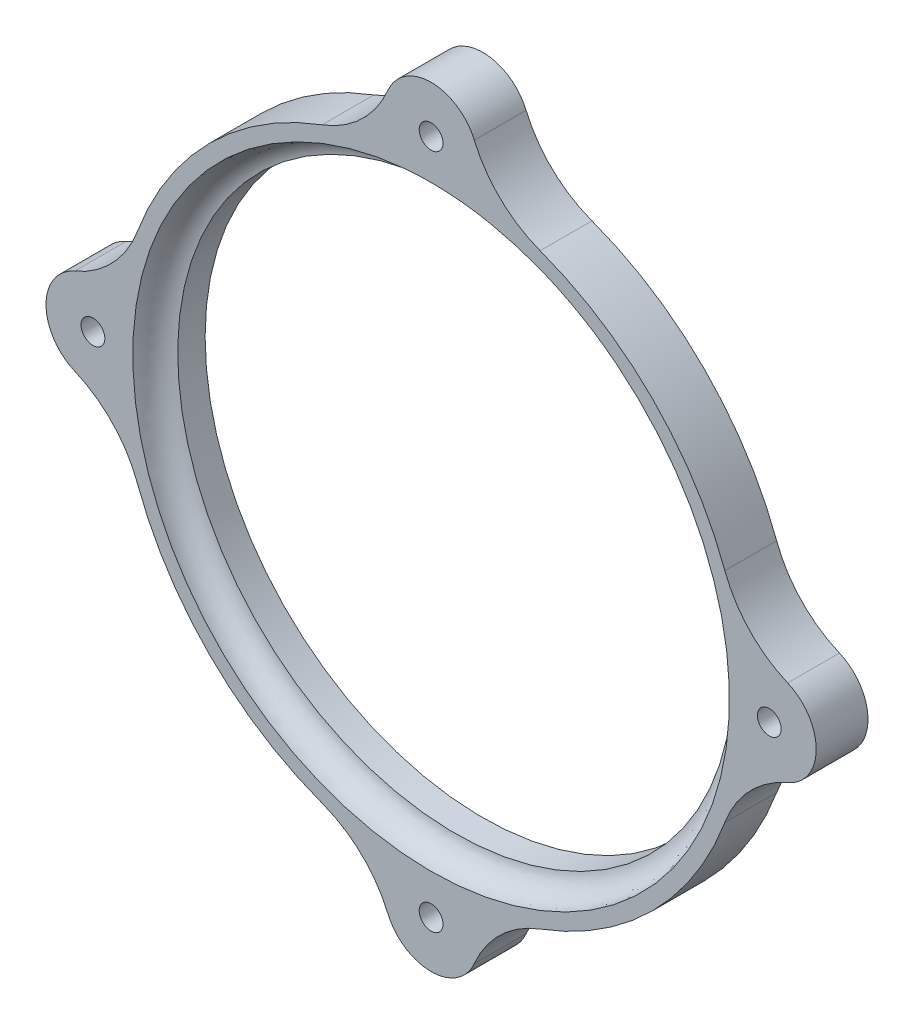
ISO-10303-21;
HEADER;
FILE_DESCRIPTION(('STEP AP214'),'2;1');
FILE_NAME('part.step','',(''),(''),'','','');
FILE_SCHEMA(('AUTOMOTIVE_DESIGN { 1 0 10303 214 1 1 1 1 }'));
ENDSEC;
DATA;
#1=APPLICATION_CONTEXT('core data for automotive mechanical design processes');
#2=APPLICATION_PROTOCOL_DEFINITION('international standard','automotive_design',2000,#1);
#3=PRODUCT_CONTEXT('',#1,'mechanical');
#4=PRODUCT('Part','Part','',(#3));
#5=PRODUCT_RELATED_PRODUCT_CATEGORY('part','',(#4));
#6=PRODUCT_DEFINITION_FORMATION('','',#4);
#7=PRODUCT_DEFINITION_CONTEXT('part definition',#1,'design');
#8=PRODUCT_DEFINITION('design','',#6,#7);
#9=PRODUCT_DEFINITION_SHAPE('','',#8);
#10=(LENGTH_UNIT() NAMED_UNIT(*) SI_UNIT(.MILLI.,.METRE.));
#11=(NAMED_UNIT(*) PLANE_ANGLE_UNIT() SI_UNIT($,.RADIAN.));
#12=(NAMED_UNIT(*) SI_UNIT($,.STERADIAN.) SOLID_ANGLE_UNIT());
#13=UNCERTAINTY_MEASURE_WITH_UNIT(LENGTH_MEASURE(1.E-05),#10,'distance_accuracy_value','');
#14=(GEOMETRIC_REPRESENTATION_CONTEXT(3) GLOBAL_UNCERTAINTY_ASSIGNED_CONTEXT((#13)) GLOBAL_UNIT_ASSIGNED_CONTEXT((#10,
#11,#12)) REPRESENTATION_CONTEXT('',''));
#15=CARTESIAN_POINT('',(0.,0.,0.));
#16=DIRECTION('',(0.,0.,1.));
#17=DIRECTION('',(1.,0.,0.));
#18=AXIS2_PLACEMENT_3D('',#15,#16,#17);
#19=CARTESIAN_POINT('',(0.,114.634431643275,75.6018381281527));
#20=DIRECTION('',(0.,6.07607714142588E-13,-1.));
#21=DIRECTION('',(1.,0.,0.));
#22=AXIS2_PLACEMENT_3D('',#19,#20,#21);
#23=PLANE('',#22);
#24=CARTESIAN_POINT('',(-32.8778362500431,57.3172158216366,75.6018381281178));
#25=DIRECTION('',(0.,6.07607714142588E-13,-1.));
#26=DIRECTION('',(1.,0.,0.));
#27=AXIS2_PLACEMENT_3D('',#24,#25,#26);
#28=CIRCLE('',#27,1.54999999999999);
#29=CARTESIAN_POINT('',(-31.3278362500431,57.3172158216366,75.6018381281178));
#30=VERTEX_POINT('',#29);
#31=EDGE_CURVE('E37',#30,#30,#28,.T.);
#32=ORIENTED_EDGE('',*,*,#31,.T.);
#33=EDGE_LOOP('',(#32));
#34=FACE_BOUND('',#33,.T.);
#35=CARTESIAN_POINT('',(11.2096637499571,101.404715821637,75.6018381281446));
#36=DIRECTION('',(0.,6.07607714142588E-13,-1.));
#37=DIRECTION('',(1.,0.,0.));
#38=AXIS2_PLACEMENT_3D('',#35,#36,#37);
#39=CIRCLE('',#38,1.54999999999999);
#40=CARTESIAN_POINT('',(12.759663749957,101.404715821637,75.6018381281446));
#41=VERTEX_POINT('',#40);
#42=EDGE_CURVE('E260',#41,#41,#39,.T.);
#43=ORIENTED_EDGE('',*,*,#42,.T.);
#44=EDGE_LOOP('',(#43));
#45=FACE_BOUND('',#44,.T.);
#46=CARTESIAN_POINT('',(55.2971637499569,57.3172158216366,75.6018381281178));
#47=DIRECTION('',(0.,6.07607714142588E-13,-1.));
#48=DIRECTION('',(1.,0.,0.));
#49=AXIS2_PLACEMENT_3D('',#46,#47,#48);
#50=CIRCLE('',#49,1.54999999999999);
#51=CARTESIAN_POINT('',(56.8471637499569,57.3172158216366,75.6018381281178));
#52=VERTEX_POINT('',#51);
#53=EDGE_CURVE('E42',#52,#52,#50,.T.);
#54=ORIENTED_EDGE('',*,*,#53,.T.);
#55=EDGE_LOOP('',(#54));
#56=FACE_BOUND('',#55,.T.);
#57=CARTESIAN_POINT('',(11.2096637499564,13.2297158216366,75.6018381280911));
#58=DIRECTION('',(0.,6.07607714142588E-13,-1.));
#59=DIRECTION('',(1.,0.,0.));
#60=AXIS2_PLACEMENT_3D('',#57,#58,#59);
#61=CIRCLE('',#60,1.54999999999999);
#62=CARTESIAN_POINT('',(12.7596637499564,13.2297158216366,75.6018381280911));
#63=VERTEX_POINT('',#62);
#64=EDGE_CURVE('E11',#63,#63,#61,.T.);
#65=ORIENTED_EDGE('',*,*,#64,.T.);
#66=EDGE_LOOP('',(#65));
#67=FACE_BOUND('',#66,.T.);
#68=CARTESIAN_POINT('',(11.2096637499569,57.3172158216366,75.6018381281178));
#69=DIRECTION('',(0.,-6.07607714142588E-13,1.));
#70=DIRECTION('',(-1.,0.,0.));
#71=AXIS2_PLACEMENT_3D('',#68,#69,#70);
#72=CIRCLE('',#71,38.8936810507353);
#73=CARTESIAN_POINT('',(0.,20.0739363703151,75.6018381280952));
#74=VERTEX_POINT('',#73);
#75=EDGE_CURVE('E222',#74,#74,#72,.T.);
#76=ORIENTED_EDGE('',*,*,#75,.F.);
#77=EDGE_LOOP('',(#76));
#78=FACE_BOUND('',#77,.T.);
#79=CARTESIAN_POINT('',(11.2096637499571,101.404715821637,75.6018381281446));
#80=DIRECTION('',(0.,6.07607714142588E-13,-1.));
#81=DIRECTION('',(1.,0.,0.));
#82=AXIS2_PLACEMENT_3D('',#79,#80,#81);
#83=CIRCLE('',#82,6.120135742462);
#84=CARTESIAN_POINT('',(5.57851822527572,103.80185194335,75.6018381281461));
#85=VERTEX_POINT('',#84);
#86=CARTESIAN_POINT('',(16.8408092746384,103.80185194335,75.6018381281461));
#87=VERTEX_POINT('',#86);
#88=EDGE_CURVE('E249',#85,#87,#83,.T.);
#89=ORIENTED_EDGE('',*,*,#88,.F.);
#90=CARTESIAN_POINT('',(-8.2230029214171,109.677055262163,75.6018381281497));
#91=DIRECTION('',(0.,6.07607714142588E-13,-1.));
#92=DIRECTION('',(1.,0.,0.));
#93=AXIS2_PLACEMENT_3D('',#90,#91,#92);
#94=CIRCLE('',#93,15.);
#95=CARTESIAN_POINT('',(-3.003810008131,95.6143376964182,75.6018381281411));
#96=VERTEX_POINT('',#95);
#97=EDGE_CURVE('E234',#96,#85,#94,.F.);
#98=ORIENTED_EDGE('',*,*,#97,.F.);
#99=CARTESIAN_POINT('',(11.2096637499569,57.3172158216366,75.6018381281178));
#100=DIRECTION('',(0.,6.07607714142588E-13,-1.));
#101=DIRECTION('',(1.,0.,0.));
#102=AXIS2_PLACEMENT_3D('',#99,#100,#101);
#103=CIRCLE('',#102,40.8496313344897);
#104=CARTESIAN_POINT('',(-27.0874581248246,71.5306895797247,75.6018381281265));
#105=VERTEX_POINT('',#104);
#106=EDGE_CURVE('E243',#105,#96,#103,.T.);
#107=ORIENTED_EDGE('',*,*,#106,.F.);
#108=CARTESIAN_POINT('',(-41.1501756905693,76.7498824930108,75.6018381281297));
#109=DIRECTION('',(0.,6.07607714142588E-13,-1.));
#110=DIRECTION('',(1.,0.,0.));
#111=AXIS2_PLACEMENT_3D('',#108,#109,#110);
#112=CIRCLE('',#111,15.);
#113=CARTESIAN_POINT('',(-35.2749723717563,62.948361346318,75.6018381281213));
#114=VERTEX_POINT('',#113);
#115=EDGE_CURVE('E241',#114,#105,#112,.F.);
#116=ORIENTED_EDGE('',*,*,#115,.F.);
#117=CARTESIAN_POINT('',(-32.8778362500431,57.3172158216366,75.6018381281178));
#118=DIRECTION('',(0.,6.07607714142588E-13,-1.));
#119=DIRECTION('',(1.,0.,0.));
#120=AXIS2_PLACEMENT_3D('',#117,#118,#119);
#121=CIRCLE('',#120,6.120135742462);
#122=CARTESIAN_POINT('',(-35.2749723717563,51.6860702969553,75.6018381281144));
#123=VERTEX_POINT('',#122);
#124=EDGE_CURVE('E240',#123,#114,#121,.T.);
#125=ORIENTED_EDGE('',*,*,#124,.F.);
#126=CARTESIAN_POINT('',(-41.1501756905693,37.8845491502625,75.601838128106));
#127=DIRECTION('',(0.,6.07607714142588E-13,-1.));
#128=DIRECTION('',(1.,0.,0.));
#129=AXIS2_PLACEMENT_3D('',#126,#127,#128);
#130=CIRCLE('',#129,15.);
#131=CARTESIAN_POINT('',(-27.0874581248246,43.1037420635486,75.6018381281092));
#132=VERTEX_POINT('',#131);
#133=EDGE_CURVE('E57',#132,#123,#130,.F.);
#134=ORIENTED_EDGE('',*,*,#133,.F.);
#135=CARTESIAN_POINT('',(11.2096637499569,57.3172158216366,75.6018381281178));
#136=DIRECTION('',(0.,6.07607714142588E-13,-1.));
#137=DIRECTION('',(1.,0.,0.));
#138=AXIS2_PLACEMENT_3D('',#135,#136,#137);
#139=CIRCLE('',#138,40.8496313344897);
#140=CARTESIAN_POINT('',(-3.00381000813154,19.0200939468553,75.6018381280946));
#141=VERTEX_POINT('',#140);
#142=EDGE_CURVE('E50',#141,#132,#139,.T.);
#143=ORIENTED_EDGE('',*,*,#142,.F.);
#144=CARTESIAN_POINT('',(-8.22300292141783,4.95737638111067,75.601838128086));
#145=DIRECTION('',(0.,6.07607714142588E-13,-1.));
#146=DIRECTION('',(1.,0.,0.));
#147=AXIS2_PLACEMENT_3D('',#144,#145,#146);
#148=CIRCLE('',#147,15.);
#149=CARTESIAN_POINT('',(5.57851822527506,10.8325796999234,75.6018381280896));
#150=VERTEX_POINT('',#149);
#151=EDGE_CURVE('E224',#150,#141,#148,.F.);
#152=ORIENTED_EDGE('',*,*,#151,.F.);
#153=CARTESIAN_POINT('',(11.2096637499564,13.2297158216366,75.6018381280911));
#154=DIRECTION('',(0.,6.07607714142588E-13,-1.));
#155=DIRECTION('',(1.,0.,0.));
#156=AXIS2_PLACEMENT_3D('',#153,#154,#155);
#157=CIRCLE('',#156,6.120135742462);
#158=CARTESIAN_POINT('',(16.8408092746377,10.8325796999233,75.6018381280896));
#159=VERTEX_POINT('',#158);
#160=EDGE_CURVE('E231',#159,#150,#157,.T.);
#161=ORIENTED_EDGE('',*,*,#160,.F.);
#162=CARTESIAN_POINT('',(30.6423304213305,4.95737638111025,75.601838128086));
#163=DIRECTION('',(0.,6.07607714142588E-13,-1.));
#164=DIRECTION('',(1.,0.,0.));
#165=AXIS2_PLACEMENT_3D('',#162,#163,#164);
#166=CIRCLE('',#165,15.);
#167=CARTESIAN_POINT('',(25.4231375080445,19.020093946855,75.6018381280946));
#168=VERTEX_POINT('',#167);
#169=EDGE_CURVE('E226',#168,#159,#166,.F.);
#170=ORIENTED_EDGE('',*,*,#169,.F.);
#171=CARTESIAN_POINT('',(11.2096637499569,57.3172158216366,75.6018381281178));
#172=DIRECTION('',(0.,6.07607714142588E-13,-1.));
#173=DIRECTION('',(1.,0.,0.));
#174=AXIS2_PLACEMENT_3D('',#171,#172,#173);
#175=CIRCLE('',#174,40.8496313344897);
#176=CARTESIAN_POINT('',(49.5067856247384,43.1037420635486,75.6018381281092));
#177=VERTEX_POINT('',#176);
#178=EDGE_CURVE('E236',#177,#168,#175,.T.);
#179=ORIENTED_EDGE('',*,*,#178,.F.);
#180=CARTESIAN_POINT('',(63.569503190483,37.8845491502625,75.601838128106));
#181=DIRECTION('',(0.,6.07607714142588E-13,-1.));
#182=DIRECTION('',(1.,0.,0.));
#183=AXIS2_PLACEMENT_3D('',#180,#181,#182);
#184=CIRCLE('',#183,15.);
#185=CARTESIAN_POINT('',(57.6942998716701,51.6860702969553,75.6018381281144));
#186=VERTEX_POINT('',#185);
#187=EDGE_CURVE('E238',#186,#177,#184,.F.);
#188=ORIENTED_EDGE('',*,*,#187,.F.);
#189=CARTESIAN_POINT('',(55.2971637499569,57.3172158216366,75.6018381281178));
#190=DIRECTION('',(0.,6.07607714142588E-13,-1.));
#191=DIRECTION('',(1.,0.,0.));
#192=AXIS2_PLACEMENT_3D('',#189,#190,#191);
#193=CIRCLE('',#192,6.120135742462);
#194=CARTESIAN_POINT('',(57.6942998716701,62.948361346318,75.6018381281213));
#195=VERTEX_POINT('',#194);
#196=EDGE_CURVE('E233',#195,#186,#193,.T.);
#197=ORIENTED_EDGE('',*,*,#196,.F.);
#198=CARTESIAN_POINT('',(63.569503190483,76.7498824930108,75.6018381281297));
#199=DIRECTION('',(0.,6.07607714142588E-13,-1.));
#200=DIRECTION('',(1.,0.,0.));
#201=AXIS2_PLACEMENT_3D('',#198,#199,#200);
#202=CIRCLE('',#201,15.);
#203=CARTESIAN_POINT('',(49.5067856247384,71.5306895797247,75.6018381281265));
#204=VERTEX_POINT('',#203);
#205=EDGE_CURVE('E247',#204,#195,#202,.F.);
#206=ORIENTED_EDGE('',*,*,#205,.F.);
#207=CARTESIAN_POINT('',(11.2096637499569,57.3172158216366,75.6018381281178));
#208=DIRECTION('',(0.,6.07607714142588E-13,-1.));
#209=DIRECTION('',(1.,0.,0.));
#210=AXIS2_PLACEMENT_3D('',#207,#208,#209);
#211=CIRCLE('',#210,40.8496313344897);
#212=CARTESIAN_POINT('',(25.423137508045,95.6143376964181,75.6018381281411));
#213=VERTEX_POINT('',#212);
#214=EDGE_CURVE('E245',#213,#204,#211,.T.);
#215=ORIENTED_EDGE('',*,*,#214,.F.);
#216=CARTESIAN_POINT('',(30.6423304213312,109.677055262163,75.6018381281497));
#217=DIRECTION('',(0.,6.07607714142588E-13,-1.));
#218=DIRECTION('',(1.,0.,0.));
#219=AXIS2_PLACEMENT_3D('',#216,#217,#218);
#220=CIRCLE('',#219,15.);
#221=EDGE_CURVE('E253',#87,#213,#220,.F.);
#222=ORIENTED_EDGE('',*,*,#221,.F.);
#223=EDGE_LOOP('',(#89,#98,#107,#116,#125,#134,#143,#152,#161,#170,#179,#188,#197,#206,#215,#222));
#224=FACE_BOUND('',#223,.T.);
#225=ADVANCED_FACE('F34',(#34,#45,#56,#67,#78,#224),#23,.F.);
#226=CARTESIAN_POINT('',(11.2096637499569,57.3172158216407,68.8518381281178));
#227=DIRECTION('',(0.,-6.07607714142588E-13,1.));
#228=DIRECTION('',(-1.,0.,0.));
#229=AXIS2_PLACEMENT_3D('',#226,#227,#228);
#230=PLANE('',#229);
#231=CARTESIAN_POINT('',(11.2096637499569,57.3172158216407,68.8518381281178));
#232=DIRECTION('',(0.,-6.07607714142588E-13,1.));
#233=DIRECTION('',(-1.,0.,0.));
#234=AXIS2_PLACEMENT_3D('',#231,#232,#233);
#235=CIRCLE('',#234,40.8496313344897);
#236=CARTESIAN_POINT('',(-27.0874581248246,43.1037420635527,68.8518381281092));
#237=VERTEX_POINT('',#236);
#238=CARTESIAN_POINT('',(-3.00381000813154,19.0200939468594,68.8518381280946));
#239=VERTEX_POINT('',#238);
#240=EDGE_CURVE('E158',#237,#239,#235,.T.);
#241=ORIENTED_EDGE('',*,*,#240,.F.);
#242=CARTESIAN_POINT('',(-41.1501756905693,37.8845491502666,68.8518381281061));
#243=DIRECTION('',(0.,-6.07607714142588E-13,1.));
#244=DIRECTION('',(-1.,0.,0.));
#245=AXIS2_PLACEMENT_3D('',#242,#243,#244);
#246=CIRCLE('',#245,15.);
#247=CARTESIAN_POINT('',(-35.2749723717563,51.6860702969594,68.8518381281144));
#248=VERTEX_POINT('',#247);
#249=EDGE_CURVE('E163',#237,#248,#246,.T.);
#250=ORIENTED_EDGE('',*,*,#249,.T.);
#251=CARTESIAN_POINT('',(-32.8778362500431,57.3172158216407,68.8518381281178));
#252=DIRECTION('',(0.,-6.07607714142588E-13,1.));
#253=DIRECTION('',(-1.,0.,0.));
#254=AXIS2_PLACEMENT_3D('',#251,#252,#253);
#255=CIRCLE('',#254,6.120135742462);
#256=CARTESIAN_POINT('',(-35.2749723717563,62.9483613463221,68.8518381281213));
#257=VERTEX_POINT('',#256);
#258=EDGE_CURVE('E189',#257,#248,#255,.T.);
#259=ORIENTED_EDGE('',*,*,#258,.F.);
#260=CARTESIAN_POINT('',(-41.1501756905693,76.7498824930149,68.8518381281297));
#261=DIRECTION('',(0.,-6.07607714142588E-13,1.));
#262=DIRECTION('',(-1.,0.,0.));
#263=AXIS2_PLACEMENT_3D('',#260,#261,#262);
#264=CIRCLE('',#263,15.);
#265=CARTESIAN_POINT('',(-27.0874581248246,71.5306895797287,68.8518381281265));
#266=VERTEX_POINT('',#265);
#267=EDGE_CURVE('E170',#257,#266,#264,.T.);
#268=ORIENTED_EDGE('',*,*,#267,.T.);
#269=CARTESIAN_POINT('',(-3.003810008131,95.6143376964223,68.8518381281411));
#270=VERTEX_POINT('',#269);
#271=EDGE_CURVE('E179',#270,#266,#235,.T.);
#272=ORIENTED_EDGE('',*,*,#271,.F.);
#273=CARTESIAN_POINT('',(-8.2230029214171,109.677055262167,68.8518381281497));
#274=DIRECTION('',(0.,-6.07607714142588E-13,1.));
#275=DIRECTION('',(-1.,0.,0.));
#276=AXIS2_PLACEMENT_3D('',#273,#274,#275);
#277=CIRCLE('',#276,15.);
#278=CARTESIAN_POINT('',(5.57851822527572,103.801851943354,68.8518381281461));
#279=VERTEX_POINT('',#278);
#280=EDGE_CURVE('E405',#270,#279,#277,.T.);
#281=ORIENTED_EDGE('',*,*,#280,.T.);
#282=CARTESIAN_POINT('',(11.2096637499571,101.404715821641,68.8518381281446));
#283=DIRECTION('',(0.,-6.07607714142588E-13,1.));
#284=DIRECTION('',(0.,1.,6.07607714142588E-13));
#285=AXIS2_PLACEMENT_3D('',#282,#283,#284);
#286=CIRCLE('',#285,6.120135742462);
#287=CARTESIAN_POINT('',(16.8408092746384,103.801851943354,68.8518381281461));
#288=VERTEX_POINT('',#287);
#289=EDGE_CURVE('E196',#288,#279,#286,.T.);
#290=ORIENTED_EDGE('',*,*,#289,.F.);
#291=CARTESIAN_POINT('',(30.6423304213312,109.677055262167,68.8518381281497));
#292=DIRECTION('',(0.,-6.07607714142588E-13,1.));
#293=DIRECTION('',(-1.,0.,0.));
#294=AXIS2_PLACEMENT_3D('',#291,#292,#293);
#295=CIRCLE('',#294,15.);
#296=CARTESIAN_POINT('',(25.423137508045,95.6143376964222,68.8518381281411));
#297=VERTEX_POINT('',#296);
#298=EDGE_CURVE('E407',#288,#297,#295,.T.);
#299=ORIENTED_EDGE('',*,*,#298,.T.);
#300=CARTESIAN_POINT('',(49.5067856247384,71.5306895797288,68.8518381281265));
#301=VERTEX_POINT('',#300);
#302=EDGE_CURVE('E182',#301,#297,#235,.T.);
#303=ORIENTED_EDGE('',*,*,#302,.F.);
#304=CARTESIAN_POINT('',(63.569503190483,76.7498824930149,68.8518381281297));
#305=DIRECTION('',(0.,-6.07607714142588E-13,1.));
#306=DIRECTION('',(-1.,0.,0.));
#307=AXIS2_PLACEMENT_3D('',#304,#305,#306);
#308=CIRCLE('',#307,15.);
#309=CARTESIAN_POINT('',(57.6942998716701,62.9483613463221,68.8518381281213));
#310=VERTEX_POINT('',#309);
#311=EDGE_CURVE('E420',#301,#310,#308,.T.);
#312=ORIENTED_EDGE('',*,*,#311,.T.);
#313=CARTESIAN_POINT('',(55.2971637499569,57.3172158216407,68.8518381281178));
#314=DIRECTION('',(0.,-6.07607714142588E-13,1.));
#315=DIRECTION('',(1.,0.,0.));
#316=AXIS2_PLACEMENT_3D('',#313,#314,#315);
#317=CIRCLE('',#316,6.120135742462);
#318=CARTESIAN_POINT('',(57.6942998716701,51.6860702969594,68.8518381281144));
#319=VERTEX_POINT('',#318);
#320=EDGE_CURVE('E202',#319,#310,#317,.T.);
#321=ORIENTED_EDGE('',*,*,#320,.F.);
#322=CARTESIAN_POINT('',(63.569503190483,37.8845491502666,68.8518381281061));
#323=DIRECTION('',(0.,-6.07607714142588E-13,1.));
#324=DIRECTION('',(-1.,0.,0.));
#325=AXIS2_PLACEMENT_3D('',#322,#323,#324);
#326=CIRCLE('',#325,15.);
#327=CARTESIAN_POINT('',(49.5067856247384,43.1037420635527,68.8518381281092));
#328=VERTEX_POINT('',#327);
#329=EDGE_CURVE('E371',#319,#328,#326,.T.);
#330=ORIENTED_EDGE('',*,*,#329,.T.);
#331=CARTESIAN_POINT('',(25.4231375080445,19.0200939468591,68.8518381280946));
#332=VERTEX_POINT('',#331);
#333=EDGE_CURVE('E177',#332,#328,#235,.T.);
#334=ORIENTED_EDGE('',*,*,#333,.F.);
#335=CARTESIAN_POINT('',(30.6423304213305,4.95737638111435,68.851838128086));
#336=DIRECTION('',(0.,-6.07607714142588E-13,1.));
#337=DIRECTION('',(-1.,0.,0.));
#338=AXIS2_PLACEMENT_3D('',#335,#336,#337);
#339=CIRCLE('',#338,15.);
#340=CARTESIAN_POINT('',(16.8408092746377,10.8325796999274,68.8518381280896));
#341=VERTEX_POINT('',#340);
#342=EDGE_CURVE('E376',#332,#341,#339,.T.);
#343=ORIENTED_EDGE('',*,*,#342,.T.);
#344=CARTESIAN_POINT('',(11.2096637499564,13.2297158216407,68.8518381280911));
#345=DIRECTION('',(0.,-6.07607714142588E-13,1.));
#346=DIRECTION('',(0.,-1.,-6.07607714142588E-13));
#347=AXIS2_PLACEMENT_3D('',#344,#345,#346);
#348=CIRCLE('',#347,6.120135742462);
#349=CARTESIAN_POINT('',(5.57851822527506,10.8325796999275,68.8518381280896));
#350=VERTEX_POINT('',#349);
#351=EDGE_CURVE('E208',#350,#341,#348,.T.);
#352=ORIENTED_EDGE('',*,*,#351,.F.);
#353=CARTESIAN_POINT('',(-8.22300292141783,4.95737638111476,68.851838128086));
#354=DIRECTION('',(0.,-6.07607714142588E-13,1.));
#355=DIRECTION('',(-1.,0.,0.));
#356=AXIS2_PLACEMENT_3D('',#353,#354,#355);
#357=CIRCLE('',#356,15.);
#358=EDGE_CURVE('E176',#350,#239,#357,.T.);
#359=ORIENTED_EDGE('',*,*,#358,.T.);
#360=EDGE_LOOP('',(#241,#250,#259,#268,#272,#281,#290,#299,#303,#312,#321,#330,#334,#343,#352,#359));
#361=FACE_BOUND('',#360,.T.);
#362=CARTESIAN_POINT('',(11.2096637499569,57.3172158216407,68.8518381281178));
#363=DIRECTION('',(0.,-6.07607714142588E-13,1.));
#364=DIRECTION('',(-1.,0.,0.));
#365=AXIS2_PLACEMENT_3D('',#362,#363,#364);
#366=CIRCLE('',#365,36.2163369894019);
#367=CARTESIAN_POINT('',(-25.006673239445,57.3172158216407,68.8518381281178));
#368=VERTEX_POINT('',#367);
#369=EDGE_CURVE('E184',#368,#368,#366,.T.);
#370=ORIENTED_EDGE('',*,*,#369,.T.);
#371=EDGE_LOOP('',(#370));
#372=FACE_BOUND('',#371,.T.);
#373=CARTESIAN_POINT('',(-32.8778362500431,57.3172158216407,68.8518381281178));
#374=DIRECTION('',(0.,-6.07607714142588E-13,1.));
#375=DIRECTION('',(-1.,0.,0.));
#376=AXIS2_PLACEMENT_3D('',#373,#374,#375);
#377=CIRCLE('',#376,1.54999999999999);
#378=CARTESIAN_POINT('',(-34.4278362500431,57.3172158216407,68.8518381281178));
#379=VERTEX_POINT('',#378);
#380=EDGE_CURVE('E191',#379,#379,#377,.T.);
#381=ORIENTED_EDGE('',*,*,#380,.T.);
#382=EDGE_LOOP('',(#381));
#383=FACE_BOUND('',#382,.T.);
#384=CARTESIAN_POINT('',(11.2096637499571,101.404715821641,68.8518381281446));
#385=DIRECTION('',(0.,-6.07607714142588E-13,1.));
#386=DIRECTION('',(0.,1.,6.07607714142588E-13));
#387=AXIS2_PLACEMENT_3D('',#384,#385,#386);
#388=CIRCLE('',#387,1.54999999999999);
#389=CARTESIAN_POINT('',(11.2096637499571,102.954715821641,68.8518381281456));
#390=VERTEX_POINT('',#389);
#391=EDGE_CURVE('E199',#390,#390,#388,.T.);
#392=ORIENTED_EDGE('',*,*,#391,.T.);
#393=EDGE_LOOP('',(#392));
#394=FACE_BOUND('',#393,.T.);
#395=CARTESIAN_POINT('',(55.2971637499569,57.3172158216407,68.8518381281178));
#396=DIRECTION('',(0.,-6.07607714142588E-13,1.));
#397=DIRECTION('',(1.,0.,0.));
#398=AXIS2_PLACEMENT_3D('',#395,#396,#397);
#399=CIRCLE('',#398,1.54999999999999);
#400=CARTESIAN_POINT('',(56.8471637499569,57.3172158216407,68.8518381281178));
#401=VERTEX_POINT('',#400);
#402=EDGE_CURVE('E205',#401,#401,#399,.T.);
#403=ORIENTED_EDGE('',*,*,#402,.T.);
#404=EDGE_LOOP('',(#403));
#405=FACE_BOUND('',#404,.T.);
#406=CARTESIAN_POINT('',(11.2096637499564,13.2297158216407,68.8518381280911));
#407=DIRECTION('',(0.,-6.07607714142588E-13,1.));
#408=DIRECTION('',(0.,-1.,-6.07607714142588E-13));
#409=AXIS2_PLACEMENT_3D('',#406,#407,#408);
#410=CIRCLE('',#409,1.54999999999999);
#411=CARTESIAN_POINT('',(11.2096637499564,11.6797158216407,68.8518381280901));
#412=VERTEX_POINT('',#411);
#413=EDGE_CURVE('E211',#412,#412,#410,.T.);
#414=ORIENTED_EDGE('',*,*,#413,.T.);
#415=EDGE_LOOP('',(#414));
#416=FACE_BOUND('',#415,.T.);
#417=ADVANCED_FACE('F172',(#361,#372,#383,#394,#405,#416),#230,.F.);
#418=CARTESIAN_POINT('',(11.2096637499569,57.3172158216325,82.3518381281179));
#419=DIRECTION('',(0.,6.07607714142588E-13,-1.));
#420=DIRECTION('',(1.,0.,0.));
#421=AXIS2_PLACEMENT_3D('',#418,#419,#420);
#422=CYLINDRICAL_SURFACE('',#421,40.8496313344897);
#423=DIRECTION('',(0.,6.07607714142588E-13,-1.));
#424=VECTOR('',#423,1.);
#425=CARTESIAN_POINT('',(-3.00381000813154,19.0200939468512,82.3518381280946));
#426=LINE('',#425,#424);
#427=EDGE_CURVE('E369',#239,#141,#426,.F.);
#428=ORIENTED_EDGE('',*,*,#427,.T.);
#429=ORIENTED_EDGE('',*,*,#142,.T.);
#430=DIRECTION('',(0.,6.07607714142588E-13,-1.));
#431=VECTOR('',#430,1.);
#432=CARTESIAN_POINT('',(-27.0874581248246,43.1037420635445,82.3518381281092));
#433=LINE('',#432,#431);
#434=EDGE_CURVE('E154',#132,#237,#433,.T.);
#435=ORIENTED_EDGE('',*,*,#434,.T.);
#436=ORIENTED_EDGE('',*,*,#240,.T.);
#437=EDGE_LOOP('',(#428,#429,#435,#436));
#438=FACE_BOUND('',#437,.T.);
#439=ADVANCED_FACE('F156',(#438),#422,.T.);
#440=CARTESIAN_POINT('',(11.2096637499564,13.229715821623,98.0438221719009));
#441=DIRECTION('',(0.,6.07607714142588E-13,-1.));
#442=DIRECTION('',(1.,0.,0.));
#443=AXIS2_PLACEMENT_3D('',#440,#441,#442);
#444=CYLINDRICAL_SURFACE('',#443,6.120135742462);
#445=DIRECTION('',(0.,6.07607714142588E-13,-1.));
#446=VECTOR('',#445,1.);
#447=CARTESIAN_POINT('',(16.8408092746377,10.8325796999097,98.0438221718994));
#448=LINE('',#447,#446);
#449=EDGE_CURVE('E365',#341,#159,#448,.F.);
#450=ORIENTED_EDGE('',*,*,#449,.T.);
#451=ORIENTED_EDGE('',*,*,#160,.T.);
#452=DIRECTION('',(0.,6.07607714142588E-13,-1.));
#453=VECTOR('',#452,1.);
#454=CARTESIAN_POINT('',(5.57851822527506,10.8325796999098,98.0438221718994));
#455=LINE('',#454,#453);
#456=EDGE_CURVE('E363',#150,#350,#455,.T.);
#457=ORIENTED_EDGE('',*,*,#456,.T.);
#458=ORIENTED_EDGE('',*,*,#351,.T.);
#459=EDGE_LOOP('',(#450,#451,#457,#458));
#460=FACE_BOUND('',#459,.T.);
#461=ADVANCED_FACE('F327',(#460),#444,.T.);
#462=CARTESIAN_POINT('',(-8.22300292141783,4.95737638110656,82.351838128086));
#463=DIRECTION('',(0.,-6.07607714142588E-13,1.));
#464=DIRECTION('',(-1.,0.,0.));
#465=AXIS2_PLACEMENT_3D('',#462,#463,#464);
#466=CYLINDRICAL_SURFACE('',#465,15.);
#467=ORIENTED_EDGE('',*,*,#456,.F.);
#468=ORIENTED_EDGE('',*,*,#151,.T.);
#469=ORIENTED_EDGE('',*,*,#427,.F.);
#470=ORIENTED_EDGE('',*,*,#358,.F.);
#471=EDGE_LOOP('',(#467,#468,#469,#470));
#472=FACE_BOUND('',#471,.T.);
#473=ADVANCED_FACE('F353',(#472),#466,.F.);
#474=DIRECTION('',(0.,6.07607714142588E-13,-1.));
#475=VECTOR('',#474,1.);
#476=CARTESIAN_POINT('',(49.5067856247384,43.1037420635445,82.3518381281092));
#477=LINE('',#476,#475);
#478=EDGE_CURVE('E417',#328,#177,#477,.F.);
#479=ORIENTED_EDGE('',*,*,#478,.T.);
#480=ORIENTED_EDGE('',*,*,#178,.T.);
#481=DIRECTION('',(0.,6.07607714142588E-13,-1.));
#482=VECTOR('',#481,1.);
#483=CARTESIAN_POINT('',(25.4231375080445,19.0200939468509,82.3518381280946));
#484=LINE('',#483,#482);
#485=EDGE_CURVE('E366',#168,#332,#484,.T.);
#486=ORIENTED_EDGE('',*,*,#485,.T.);
#487=ORIENTED_EDGE('',*,*,#333,.T.);
#488=EDGE_LOOP('',(#479,#480,#486,#487));
#489=FACE_BOUND('',#488,.T.);
#490=ADVANCED_FACE('F328',(#489),#422,.T.);
#491=CARTESIAN_POINT('',(30.6423304213305,4.95737638109661,98.0438221718958));
#492=DIRECTION('',(0.,-6.07607714142588E-13,1.));
#493=DIRECTION('',(-1.,0.,0.));
#494=AXIS2_PLACEMENT_3D('',#491,#492,#493);
#495=CYLINDRICAL_SURFACE('',#494,15.);
#496=ORIENTED_EDGE('',*,*,#485,.F.);
#497=ORIENTED_EDGE('',*,*,#169,.T.);
#498=ORIENTED_EDGE('',*,*,#449,.F.);
#499=ORIENTED_EDGE('',*,*,#342,.F.);
#500=EDGE_LOOP('',(#496,#497,#498,#499));
#501=FACE_BOUND('',#500,.T.);
#502=ADVANCED_FACE('F350',(#501),#495,.F.);
#503=CARTESIAN_POINT('',(55.2971637499569,57.317215821623,98.0438221719276));
#504=DIRECTION('',(0.,6.07607714142588E-13,-1.));
#505=DIRECTION('',(1.,0.,0.));
#506=AXIS2_PLACEMENT_3D('',#503,#504,#505);
#507=CYLINDRICAL_SURFACE('',#506,6.120135742462);
#508=DIRECTION('',(0.,6.07607714142588E-13,-1.));
#509=VECTOR('',#508,1.);
#510=CARTESIAN_POINT('',(57.6942998716701,62.9483613463043,98.0438221719311));
#511=LINE('',#510,#509);
#512=EDGE_CURVE('E414',#310,#195,#511,.F.);
#513=ORIENTED_EDGE('',*,*,#512,.T.);
#514=ORIENTED_EDGE('',*,*,#196,.T.);
#515=DIRECTION('',(0.,6.07607714142588E-13,-1.));
#516=VECTOR('',#515,1.);
#517=CARTESIAN_POINT('',(57.6942998716701,51.6860702969417,98.0438221719242));
#518=LINE('',#517,#516);
#519=EDGE_CURVE('E412',#186,#319,#518,.T.);
#520=ORIENTED_EDGE('',*,*,#519,.T.);
#521=ORIENTED_EDGE('',*,*,#320,.T.);
#522=EDGE_LOOP('',(#513,#514,#520,#521));
#523=FACE_BOUND('',#522,.T.);
#524=ADVANCED_FACE('F348',(#523),#507,.T.);
#525=CARTESIAN_POINT('',(63.569503190483,37.8845491502584,82.351838128106));
#526=DIRECTION('',(0.,-6.07607714142588E-13,1.));
#527=DIRECTION('',(-1.,0.,0.));
#528=AXIS2_PLACEMENT_3D('',#525,#526,#527);
#529=CYLINDRICAL_SURFACE('',#528,15.);
#530=ORIENTED_EDGE('',*,*,#519,.F.);
#531=ORIENTED_EDGE('',*,*,#187,.T.);
#532=ORIENTED_EDGE('',*,*,#478,.F.);
#533=ORIENTED_EDGE('',*,*,#329,.F.);
#534=EDGE_LOOP('',(#530,#531,#532,#533));
#535=FACE_BOUND('',#534,.T.);
#536=ADVANCED_FACE('F345',(#535),#529,.F.);
#537=DIRECTION('',(0.,6.07607714142588E-13,-1.));
#538=VECTOR('',#537,1.);
#539=CARTESIAN_POINT('',(25.423137508045,95.614337696414,82.3518381281411));
#540=LINE('',#539,#538);
#541=EDGE_CURVE('E402',#297,#213,#540,.F.);
#542=ORIENTED_EDGE('',*,*,#541,.T.);
#543=ORIENTED_EDGE('',*,*,#214,.T.);
#544=DIRECTION('',(0.,6.07607714142588E-13,-1.));
#545=VECTOR('',#544,1.);
#546=CARTESIAN_POINT('',(49.5067856247384,71.5306895797206,82.3518381281265));
#547=LINE('',#546,#545);
#548=EDGE_CURVE('E410',#204,#301,#547,.T.);
#549=ORIENTED_EDGE('',*,*,#548,.T.);
#550=ORIENTED_EDGE('',*,*,#302,.T.);
#551=EDGE_LOOP('',(#542,#543,#549,#550));
#552=FACE_BOUND('',#551,.T.);
#553=ADVANCED_FACE('F343',(#552),#422,.T.);
#554=CARTESIAN_POINT('',(63.569503190483,76.7498824929972,98.0438221719395));
#555=DIRECTION('',(0.,-6.07607714142588E-13,1.));
#556=DIRECTION('',(-1.,0.,0.));
#557=AXIS2_PLACEMENT_3D('',#554,#555,#556);
#558=CYLINDRICAL_SURFACE('',#557,15.);
#559=ORIENTED_EDGE('',*,*,#548,.F.);
#560=ORIENTED_EDGE('',*,*,#205,.T.);
#561=ORIENTED_EDGE('',*,*,#512,.F.);
#562=ORIENTED_EDGE('',*,*,#311,.F.);
#563=EDGE_LOOP('',(#559,#560,#561,#562));
#564=FACE_BOUND('',#563,.T.);
#565=ADVANCED_FACE('F340',(#564),#558,.F.);
#566=CARTESIAN_POINT('',(11.2096637499571,101.404715821623,98.0438221719544));
#567=DIRECTION('',(0.,6.07607714142588E-13,-1.));
#568=DIRECTION('',(1.,0.,0.));
#569=AXIS2_PLACEMENT_3D('',#566,#567,#568);
#570=CYLINDRICAL_SURFACE('',#569,6.120135742462);
#571=DIRECTION('',(0.,6.07607714142588E-13,-1.));
#572=VECTOR('',#571,1.);
#573=CARTESIAN_POINT('',(5.57851822527572,103.801851943336,98.0438221719559));
#574=LINE('',#573,#572);
#575=EDGE_CURVE('E399',#279,#85,#574,.F.);
#576=ORIENTED_EDGE('',*,*,#575,.T.);
#577=ORIENTED_EDGE('',*,*,#88,.T.);
#578=DIRECTION('',(0.,6.07607714142588E-13,-1.));
#579=VECTOR('',#578,1.);
#580=CARTESIAN_POINT('',(16.8408092746384,103.801851943336,98.0438221719559));
#581=LINE('',#580,#579);
#582=EDGE_CURVE('E397',#87,#288,#581,.T.);
#583=ORIENTED_EDGE('',*,*,#582,.T.);
#584=ORIENTED_EDGE('',*,*,#289,.T.);
#585=EDGE_LOOP('',(#576,#577,#583,#584));
#586=FACE_BOUND('',#585,.T.);
#587=ADVANCED_FACE('F338',(#586),#570,.T.);
#588=CARTESIAN_POINT('',(30.6423304213312,109.677055262159,82.3518381281497));
#589=DIRECTION('',(0.,-6.07607714142588E-13,1.));
#590=DIRECTION('',(-1.,0.,0.));
#591=AXIS2_PLACEMENT_3D('',#588,#589,#590);
#592=CYLINDRICAL_SURFACE('',#591,15.);
#593=ORIENTED_EDGE('',*,*,#582,.F.);
#594=ORIENTED_EDGE('',*,*,#221,.T.);
#595=ORIENTED_EDGE('',*,*,#541,.F.);
#596=ORIENTED_EDGE('',*,*,#298,.F.);
#597=EDGE_LOOP('',(#593,#594,#595,#596));
#598=FACE_BOUND('',#597,.T.);
#599=ADVANCED_FACE('F335',(#598),#592,.F.);
#600=DIRECTION('',(0.,6.07607714142588E-13,-1.));
#601=VECTOR('',#600,1.);
#602=CARTESIAN_POINT('',(-27.0874581248246,71.5306895797206,82.3518381281265));
#603=LINE('',#602,#601);
#604=EDGE_CURVE('E161',#266,#105,#603,.F.);
#605=ORIENTED_EDGE('',*,*,#604,.T.);
#606=ORIENTED_EDGE('',*,*,#106,.T.);
#607=DIRECTION('',(0.,6.07607714142588E-13,-1.));
#608=VECTOR('',#607,1.);
#609=CARTESIAN_POINT('',(-3.003810008131,95.6143376964141,82.3518381281411));
#610=LINE('',#609,#608);
#611=EDGE_CURVE('E395',#96,#270,#610,.T.);
#612=ORIENTED_EDGE('',*,*,#611,.T.);
#613=ORIENTED_EDGE('',*,*,#271,.T.);
#614=EDGE_LOOP('',(#605,#606,#612,#613));
#615=FACE_BOUND('',#614,.T.);
#616=ADVANCED_FACE('F297',(#615),#422,.T.);
#617=CARTESIAN_POINT('',(-8.2230029214171,109.677055262149,98.0438221719594));
#618=DIRECTION('',(0.,-6.07607714142588E-13,1.));
#619=DIRECTION('',(-1.,0.,0.));
#620=AXIS2_PLACEMENT_3D('',#617,#618,#619);
#621=CYLINDRICAL_SURFACE('',#620,15.);
#622=ORIENTED_EDGE('',*,*,#611,.F.);
#623=ORIENTED_EDGE('',*,*,#97,.T.);
#624=ORIENTED_EDGE('',*,*,#575,.F.);
#625=ORIENTED_EDGE('',*,*,#280,.F.);
#626=EDGE_LOOP('',(#622,#623,#624,#625));
#627=FACE_BOUND('',#626,.T.);
#628=ADVANCED_FACE('F287',(#627),#621,.F.);
#629=CARTESIAN_POINT('',(11.2096637499564,13.229715821623,98.0438221719009));
#630=DIRECTION('',(0.,6.07607714142588E-13,-1.));
#631=DIRECTION('',(1.,0.,0.));
#632=AXIS2_PLACEMENT_3D('',#629,#630,#631);
#633=CYLINDRICAL_SURFACE('',#632,1.54999999999999);
#634=ORIENTED_EDGE('',*,*,#64,.F.);
#635=EDGE_LOOP('',(#634));
#636=FACE_BOUND('',#635,.T.);
#637=ORIENTED_EDGE('',*,*,#413,.F.);
#638=EDGE_LOOP('',(#637));
#639=FACE_BOUND('',#638,.T.);
#640=ADVANCED_FACE('F284',(#636,#639),#633,.F.);
#641=CARTESIAN_POINT('',(55.2971637499569,57.317215821623,98.0438221719276));
#642=DIRECTION('',(0.,6.07607714142588E-13,-1.));
#643=DIRECTION('',(1.,0.,0.));
#644=AXIS2_PLACEMENT_3D('',#641,#642,#643);
#645=CYLINDRICAL_SURFACE('',#644,1.54999999999999);
#646=ORIENTED_EDGE('',*,*,#53,.F.);
#647=EDGE_LOOP('',(#646));
#648=FACE_BOUND('',#647,.T.);
#649=ORIENTED_EDGE('',*,*,#402,.F.);
#650=EDGE_LOOP('',(#649));
#651=FACE_BOUND('',#650,.T.);
#652=ADVANCED_FACE('F286',(#648,#651),#645,.F.);
#653=CARTESIAN_POINT('',(11.2096637499571,101.404715821623,98.0438221719544));
#654=DIRECTION('',(0.,6.07607714142588E-13,-1.));
#655=DIRECTION('',(1.,0.,0.));
#656=AXIS2_PLACEMENT_3D('',#653,#654,#655);
#657=CYLINDRICAL_SURFACE('',#656,1.54999999999999);
#658=ORIENTED_EDGE('',*,*,#42,.F.);
#659=EDGE_LOOP('',(#658));
#660=FACE_BOUND('',#659,.T.);
#661=ORIENTED_EDGE('',*,*,#391,.F.);
#662=EDGE_LOOP('',(#661));
#663=FACE_BOUND('',#662,.T.);
#664=ADVANCED_FACE('F294',(#660,#663),#657,.F.);
#665=CARTESIAN_POINT('',(-32.8778362500431,57.317215821623,98.0438221719276));
#666=DIRECTION('',(0.,6.07607714142588E-13,-1.));
#667=DIRECTION('',(1.,0.,0.));
#668=AXIS2_PLACEMENT_3D('',#665,#666,#667);
#669=CYLINDRICAL_SURFACE('',#668,6.120135742462);
#670=DIRECTION('',(0.,6.07607714142588E-13,-1.));
#671=VECTOR('',#670,1.);
#672=CARTESIAN_POINT('',(-35.2749723717563,51.6860702969417,98.0438221719242));
#673=LINE('',#672,#671);
#674=EDGE_CURVE('E166',#248,#123,#673,.F.);
#675=ORIENTED_EDGE('',*,*,#674,.T.);
#676=ORIENTED_EDGE('',*,*,#124,.T.);
#677=DIRECTION('',(0.,6.07607714142588E-13,-1.));
#678=VECTOR('',#677,1.);
#679=CARTESIAN_POINT('',(-35.2749723717563,62.9483613463043,98.0438221719311));
#680=LINE('',#679,#678);
#681=EDGE_CURVE('E160',#114,#257,#680,.T.);
#682=ORIENTED_EDGE('',*,*,#681,.T.);
#683=ORIENTED_EDGE('',*,*,#258,.T.);
#684=EDGE_LOOP('',(#675,#676,#682,#683));
#685=FACE_BOUND('',#684,.T.);
#686=ADVANCED_FACE('F323',(#685),#669,.T.);
#687=CARTESIAN_POINT('',(-41.1501756905693,76.7498824930067,82.3518381281297));
#688=DIRECTION('',(0.,-6.07607714142588E-13,1.));
#689=DIRECTION('',(-1.,0.,0.));
#690=AXIS2_PLACEMENT_3D('',#687,#688,#689);
#691=CYLINDRICAL_SURFACE('',#690,15.);
#692=ORIENTED_EDGE('',*,*,#681,.F.);
#693=ORIENTED_EDGE('',*,*,#115,.T.);
#694=ORIENTED_EDGE('',*,*,#604,.F.);
#695=ORIENTED_EDGE('',*,*,#267,.F.);
#696=EDGE_LOOP('',(#692,#693,#694,#695));
#697=FACE_BOUND('',#696,.T.);
#698=ADVANCED_FACE('F331',(#697),#691,.F.);
#699=CARTESIAN_POINT('',(-41.1501756905693,37.8845491502488,98.0438221719158));
#700=DIRECTION('',(0.,-6.07607714142588E-13,1.));
#701=DIRECTION('',(-1.,0.,0.));
#702=AXIS2_PLACEMENT_3D('',#699,#700,#701);
#703=CYLINDRICAL_SURFACE('',#702,15.);
#704=ORIENTED_EDGE('',*,*,#434,.F.);
#705=ORIENTED_EDGE('',*,*,#133,.T.);
#706=ORIENTED_EDGE('',*,*,#674,.F.);
#707=ORIENTED_EDGE('',*,*,#249,.F.);
#708=EDGE_LOOP('',(#704,#705,#706,#707));
#709=FACE_BOUND('',#708,.T.);
#710=ADVANCED_FACE('F164',(#709),#703,.F.);
#711=CARTESIAN_POINT('',(-32.8778362500431,57.317215821623,98.0438221719276));
#712=DIRECTION('',(0.,6.07607714142588E-13,-1.));
#713=DIRECTION('',(1.,0.,0.));
#714=AXIS2_PLACEMENT_3D('',#711,#712,#713);
#715=CYLINDRICAL_SURFACE('',#714,1.54999999999999);
#716=ORIENTED_EDGE('',*,*,#31,.F.);
#717=EDGE_LOOP('',(#716));
#718=FACE_BOUND('',#717,.T.);
#719=ORIENTED_EDGE('',*,*,#380,.F.);
#720=EDGE_LOOP('',(#719));
#721=FACE_BOUND('',#720,.T.);
#722=ADVANCED_FACE('F268',(#718,#721),#715,.F.);
#723=CARTESIAN_POINT('',(11.2096637499569,57.3172158216325,82.3518381281179));
#724=DIRECTION('',(0.,6.07607714142588E-13,-1.));
#725=DIRECTION('',(1.,0.,0.));
#726=AXIS2_PLACEMENT_3D('',#723,#724,#725);
#727=CYLINDRICAL_SURFACE('',#726,36.2163369894019);
#728=CARTESIAN_POINT('',(11.2096637499569,57.3172158216386,72.4262590110947));
#729=DIRECTION('',(0.,-6.07607714142588E-13,1.));
#730=DIRECTION('',(-1.,0.,0.));
#731=AXIS2_PLACEMENT_3D('',#728,#729,#730);
#732=CIRCLE('',#731,36.2163369894019);
#733=CARTESIAN_POINT('',(0.,22.8793514345599,72.4262590110738));
#734=VERTEX_POINT('',#733);
#735=EDGE_CURVE('E220',#734,#734,#732,.F.);
#736=ORIENTED_EDGE('',*,*,#735,.F.);
#737=EDGE_LOOP('',(#736));
#738=FACE_BOUND('',#737,.T.);
#739=ORIENTED_EDGE('',*,*,#369,.F.);
#740=EDGE_LOOP('',(#739));
#741=FACE_BOUND('',#740,.T.);
#742=ADVANCED_FACE('F271',(#738,#741),#727,.F.);
#743=CARTESIAN_POINT('',(0.,23.2739363703131,78.8018381280972));
#744=CARTESIAN_POINT('',(68.0865589026431,0.854608870399357,78.8018381280836));
#745=CARTESIAN_POINT('',(90.5058864025569,68.9411677730424,78.8018381281249));
#746=CARTESIAN_POINT('',(22.4193274999138,91.3604952729562,78.8018381281385));
#747=CARTESIAN_POINT('',(-45.6672314027293,113.77982277287,78.8018381281522));
#748=CARTESIAN_POINT('',(-68.0865589026431,45.6932638702269,78.8018381281108));
#749=CARTESIAN_POINT('',(0.,23.2739363703131,78.8018381280972));
#750=CARTESIAN_POINT('',(0.,16.8739363703131,78.8018381280933));
#751=CARTESIAN_POINT('',(80.8865589026431,-5.54539112960069,78.8018381280797));
#752=CARTESIAN_POINT('',(103.305886402557,75.3411677730425,78.8018381281288));
#753=CARTESIAN_POINT('',(22.4193274999138,97.7604952729563,78.8018381281424));
#754=CARTESIAN_POINT('',(-58.4672314027294,120.17982277287,78.801838128156));
#755=CARTESIAN_POINT('',(-80.8865589026431,39.2932638702269,78.8018381281069));
#756=CARTESIAN_POINT('',(0.,16.8739363703131,78.8018381280933));
#757=CARTESIAN_POINT('',(0.,16.873936370317,72.4018381280932));
#758=CARTESIAN_POINT('',(80.8865589026431,-5.5453911295968,72.4018381280796));
#759=CARTESIAN_POINT('',(103.305886402557,75.3411677730464,72.4018381281288));
#760=CARTESIAN_POINT('',(22.4193274999138,97.7604952729602,72.4018381281424));
#761=CARTESIAN_POINT('',(-58.4672314027294,120.179822772874,72.401838128156));
#762=CARTESIAN_POINT('',(-80.8865589026431,39.2932638702308,72.4018381281069));
#763=CARTESIAN_POINT('',(0.,16.873936370317,72.4018381280932));
#764=CARTESIAN_POINT('',(0.,23.273936370317,72.4018381280972));
#765=CARTESIAN_POINT('',(68.0865589026431,0.854608870403249,72.4018381280835));
#766=CARTESIAN_POINT('',(90.5058864025569,68.9411677730463,72.4018381281249));
#767=CARTESIAN_POINT('',(22.4193274999138,91.3604952729601,72.4018381281385));
#768=CARTESIAN_POINT('',(-45.6672314027293,113.779822772874,72.4018381281521));
#769=CARTESIAN_POINT('',(-68.0865589026431,45.6932638702308,72.4018381281108));
#770=CARTESIAN_POINT('',(0.,23.273936370317,72.4018381280972));
#771=CARTESIAN_POINT('',(0.,29.6739363703171,72.401838128101));
#772=CARTESIAN_POINT('',(55.286558902643,7.25460887040326,72.4018381280874));
#773=CARTESIAN_POINT('',(77.7058864025568,62.5411677730463,72.401838128121));
#774=CARTESIAN_POINT('',(22.4193274999138,84.9604952729601,72.4018381281346));
#775=CARTESIAN_POINT('',(-32.8672314027292,107.379822772874,72.4018381281483));
#776=CARTESIAN_POINT('',(-55.286558902643,52.0932638702308,72.4018381281147));
#777=CARTESIAN_POINT('',(0.,29.6739363703171,72.401838128101));
#778=CARTESIAN_POINT('',(0.,29.6739363703132,78.8018381281011));
#779=CARTESIAN_POINT('',(55.286558902643,7.25460887039937,78.8018381280874));
#780=CARTESIAN_POINT('',(77.7058864025568,62.5411677730424,78.801838128121));
#781=CARTESIAN_POINT('',(22.4193274999138,84.9604952729562,78.8018381281346));
#782=CARTESIAN_POINT('',(-32.8672314027292,107.37982277287,78.8018381281483));
#783=CARTESIAN_POINT('',(-55.286558902643,52.093263870227,78.8018381281147));
#784=CARTESIAN_POINT('',(0.,29.6739363703132,78.8018381281011));
#785=CARTESIAN_POINT('',(0.,23.2739363703131,78.8018381280972));
#786=CARTESIAN_POINT('',(68.0865589026431,0.854608870399357,78.8018381280836));
#787=CARTESIAN_POINT('',(90.5058864025569,68.9411677730424,78.8018381281249));
#788=CARTESIAN_POINT('',(22.4193274999138,91.3604952729562,78.8018381281385));
#789=CARTESIAN_POINT('',(-45.6672314027293,113.77982277287,78.8018381281522));
#790=CARTESIAN_POINT('',(-68.0865589026431,45.6932638702269,78.8018381281108));
#791=CARTESIAN_POINT('',(0.,23.2739363703131,78.8018381280972));
#792=(BOUNDED_SURFACE() B_SPLINE_SURFACE(3,3,((#743,#744,#745,#746,#747,#748,#749),(#750,#751,
#752,#753,#754,#755,#756),(#757,#758,#759,#760,#761,#762,#763),(#764,#765,#766,#767,#768,#769,
#770),(#771,#772,#773,#774,#775,#776,#777),(#778,#779,#780,#781,#782,#783,#784),(#785,#786,#787,
#788,#789,#790,#791)),.UNSPECIFIED.,.T.,.T.,.F.) B_SPLINE_SURFACE_WITH_KNOTS((4,3,4),(4,3,4),
(0.,0.5,1.),(0.,0.5,1.),
.UNSPECIFIED.) GEOMETRIC_REPRESENTATION_ITEM() RATIONAL_B_SPLINE_SURFACE(((1.,0.333333333333333,
0.333333333333333,1.,0.333333333333333,0.333333333333333,1.),(0.333333333333333,
0.111111111111111,0.111111111111111,0.333333333333333,0.111111111111111,0.111111111111111,
0.333333333333333),(0.333333333333333,0.111111111111111,0.111111111111111,0.333333333333333,
0.111111111111111,0.111111111111111,0.333333333333333),(1.,0.333333333333333,0.333333333333333,
1.,0.333333333333333,0.333333333333333,1.),(0.333333333333333,0.111111111111111,
0.111111111111111,0.333333333333333,0.111111111111111,0.111111111111111,0.333333333333333),
(0.333333333333333,0.111111111111111,0.111111111111111,0.333333333333333,0.111111111111111,
0.111111111111111,0.333333333333333),(1.,0.333333333333333,0.333333333333333,1.,
0.333333333333333,0.333333333333333,1.))) REPRESENTATION_ITEM('') SURFACE());
#793=CARTESIAN_POINT('',(0.,23.2739363703151,75.6018381280972));
#794=DIRECTION('',(1.,0.,0.));
#795=DIRECTION('',(0.,-6.07607714142588E-13,1.));
#796=AXIS2_PLACEMENT_3D('',#793,#794,#795);
#797=CIRCLE('',#796,3.20000000000001);
#798=EDGE_CURVE('E214',#74,#734,#797,.T.);
#799=ORIENTED_EDGE('',*,*,#798,.F.);
#800=ORIENTED_EDGE('',*,*,#75,.T.);
#801=ORIENTED_EDGE('',*,*,#798,.T.);
#802=ORIENTED_EDGE('',*,*,#735,.T.);
#803=EDGE_LOOP('',(#799,#800,#801,#802));
#804=FACE_BOUND('',#803,.T.);
#805=ADVANCED_FACE('F218',(#804),#792,.F.);
#806=CLOSED_SHELL('',(#225,#417,#439,#461,#473,#490,#502,#524,#536,#553,#565,#587,#599,#616,
#628,#640,#652,#664,#686,#698,#710,#722,#742,#805));
#807=MANIFOLD_SOLID_BREP('B2',#806);
#808=ADVANCED_BREP_SHAPE_REPRESENTATION('',(#18,#807),#14);
#809=SHAPE_DEFINITION_REPRESENTATION(#9,#808);
ENDSEC;
END-ISO-10303-21;
